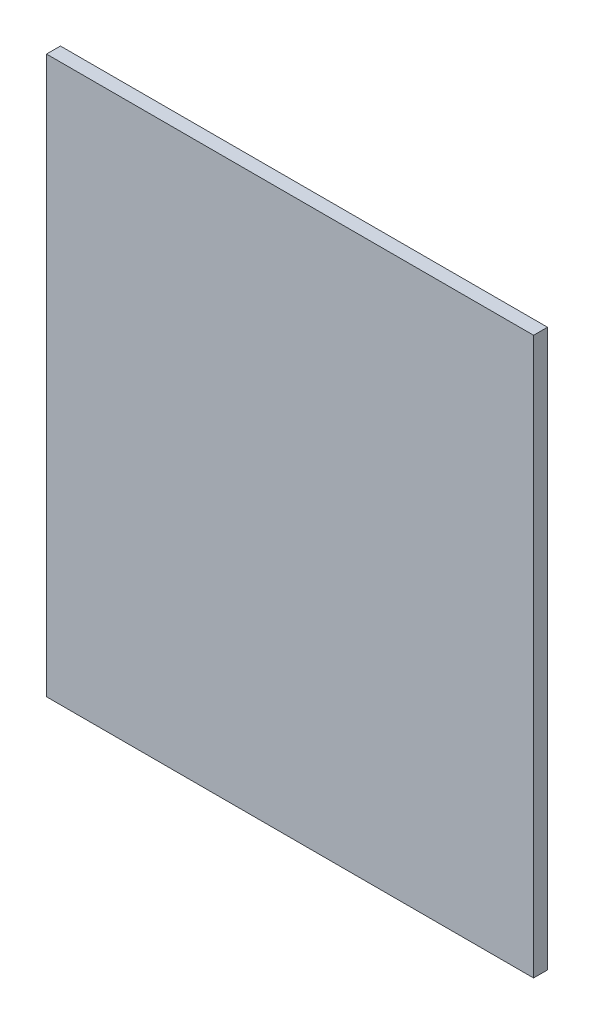
ISO-10303-21;
HEADER;
FILE_DESCRIPTION(('STEP AP214'),'2;1');
FILE_NAME('part.step','',(''),(''),'','','');
FILE_SCHEMA(('AUTOMOTIVE_DESIGN { 1 0 10303 214 1 1 1 1 }'));
ENDSEC;
DATA;
#1=APPLICATION_CONTEXT('core data for automotive mechanical design processes');
#2=APPLICATION_PROTOCOL_DEFINITION('international standard','automotive_design',2000,#1);
#3=PRODUCT_CONTEXT('',#1,'mechanical');
#4=PRODUCT('Part','Part','',(#3));
#5=PRODUCT_RELATED_PRODUCT_CATEGORY('part','',(#4));
#6=PRODUCT_DEFINITION_FORMATION('','',#4);
#7=PRODUCT_DEFINITION_CONTEXT('part definition',#1,'design');
#8=PRODUCT_DEFINITION('design','',#6,#7);
#9=PRODUCT_DEFINITION_SHAPE('','',#8);
#10=(LENGTH_UNIT() NAMED_UNIT(*) SI_UNIT(.MILLI.,.METRE.));
#11=(NAMED_UNIT(*) PLANE_ANGLE_UNIT() SI_UNIT($,.RADIAN.));
#12=(NAMED_UNIT(*) SI_UNIT($,.STERADIAN.) SOLID_ANGLE_UNIT());
#13=UNCERTAINTY_MEASURE_WITH_UNIT(LENGTH_MEASURE(1.E-05),#10,'distance_accuracy_value','');
#14=(GEOMETRIC_REPRESENTATION_CONTEXT(3) GLOBAL_UNCERTAINTY_ASSIGNED_CONTEXT((#13)) GLOBAL_UNIT_ASSIGNED_CONTEXT((#10,
#11,#12)) REPRESENTATION_CONTEXT('',''));
#15=CARTESIAN_POINT('',(0.,0.,0.));
#16=DIRECTION('',(0.,0.,1.));
#17=DIRECTION('',(1.,0.,0.));
#18=AXIS2_PLACEMENT_3D('',#15,#16,#17);
#19=CARTESIAN_POINT('',(0.,0.,2.54));
#20=DIRECTION('',(0.,1.,0.));
#21=DIRECTION('',(0.,0.,1.));
#22=AXIS2_PLACEMENT_3D('',#19,#20,#21);
#23=PLANE('',#22);
#24=DIRECTION('',(1.,0.,0.));
#25=VECTOR('',#24,1.);
#26=CARTESIAN_POINT('',(0.,0.,0.));
#27=LINE('',#26,#25);
#28=CARTESIAN_POINT('',(-88.9,0.,0.));
#29=VERTEX_POINT('',#28);
#30=CARTESIAN_POINT('',(0.,0.,0.));
#31=VERTEX_POINT('',#30);
#32=EDGE_CURVE('E113',#29,#31,#27,.T.);
#33=ORIENTED_EDGE('',*,*,#32,.T.);
#34=DIRECTION('',(0.,0.,-1.));
#35=VECTOR('',#34,1.);
#36=CARTESIAN_POINT('',(0.,0.,2.54));
#37=LINE('',#36,#35);
#38=CARTESIAN_POINT('',(0.,0.,2.54));
#39=VERTEX_POINT('',#38);
#40=EDGE_CURVE('E11',#39,#31,#37,.T.);
#41=ORIENTED_EDGE('',*,*,#40,.F.);
#42=DIRECTION('',(1.,0.,0.));
#43=VECTOR('',#42,1.);
#44=CARTESIAN_POINT('',(0.,0.,2.54));
#45=LINE('',#44,#43);
#46=CARTESIAN_POINT('',(-88.9,0.,2.54));
#47=VERTEX_POINT('',#46);
#48=EDGE_CURVE('E97',#47,#39,#45,.T.);
#49=ORIENTED_EDGE('',*,*,#48,.F.);
#50=DIRECTION('',(0.,0.,-1.));
#51=VECTOR('',#50,1.);
#52=CARTESIAN_POINT('',(-88.9,0.,2.54));
#53=LINE('',#52,#51);
#54=EDGE_CURVE('E109',#47,#29,#53,.T.);
#55=ORIENTED_EDGE('',*,*,#54,.T.);
#56=EDGE_LOOP('',(#33,#41,#49,#55));
#57=FACE_BOUND('',#56,.T.);
#58=ADVANCED_FACE('F45',(#57),#23,.F.);
#59=CARTESIAN_POINT('',(0.,0.,2.54));
#60=DIRECTION('',(-1.,0.,0.));
#61=DIRECTION('',(0.,0.,1.));
#62=AXIS2_PLACEMENT_3D('',#59,#60,#61);
#63=PLANE('',#62);
#64=DIRECTION('',(0.,1.,0.));
#65=VECTOR('',#64,1.);
#66=CARTESIAN_POINT('',(0.,0.,0.));
#67=LINE('',#66,#65);
#68=CARTESIAN_POINT('',(0.,101.6,0.));
#69=VERTEX_POINT('',#68);
#70=EDGE_CURVE('E102',#31,#69,#67,.T.);
#71=ORIENTED_EDGE('',*,*,#70,.T.);
#72=DIRECTION('',(0.,0.,-1.));
#73=VECTOR('',#72,1.);
#74=CARTESIAN_POINT('',(0.,101.6,2.54));
#75=LINE('',#74,#73);
#76=CARTESIAN_POINT('',(0.,101.6,2.54));
#77=VERTEX_POINT('',#76);
#78=EDGE_CURVE('E54',#77,#69,#75,.T.);
#79=ORIENTED_EDGE('',*,*,#78,.F.);
#80=DIRECTION('',(0.,1.,0.));
#81=VECTOR('',#80,1.);
#82=CARTESIAN_POINT('',(0.,0.,2.54));
#83=LINE('',#82,#81);
#84=EDGE_CURVE('E92',#39,#77,#83,.T.);
#85=ORIENTED_EDGE('',*,*,#84,.F.);
#86=ORIENTED_EDGE('',*,*,#40,.T.);
#87=EDGE_LOOP('',(#71,#79,#85,#86));
#88=FACE_BOUND('',#87,.T.);
#89=ADVANCED_FACE('F101',(#88),#63,.F.);
#90=CARTESIAN_POINT('',(0.,101.6,2.54));
#91=DIRECTION('',(0.,-1.,0.));
#92=DIRECTION('',(0.,0.,-1.));
#93=AXIS2_PLACEMENT_3D('',#90,#91,#92);
#94=PLANE('',#93);
#95=DIRECTION('',(-1.,0.,0.));
#96=VECTOR('',#95,1.);
#97=CARTESIAN_POINT('',(0.,101.6,0.));
#98=LINE('',#97,#96);
#99=CARTESIAN_POINT('',(-88.9,101.6,0.));
#100=VERTEX_POINT('',#99);
#101=EDGE_CURVE('E79',#69,#100,#98,.T.);
#102=ORIENTED_EDGE('',*,*,#101,.T.);
#103=DIRECTION('',(0.,0.,-1.));
#104=VECTOR('',#103,1.);
#105=CARTESIAN_POINT('',(-88.9,101.6,2.54));
#106=LINE('',#105,#104);
#107=CARTESIAN_POINT('',(-88.9,101.6,2.54));
#108=VERTEX_POINT('',#107);
#109=EDGE_CURVE('E104',#108,#100,#106,.T.);
#110=ORIENTED_EDGE('',*,*,#109,.F.);
#111=DIRECTION('',(-1.,0.,0.));
#112=VECTOR('',#111,1.);
#113=CARTESIAN_POINT('',(0.,101.6,2.54));
#114=LINE('',#113,#112);
#115=EDGE_CURVE('E95',#77,#108,#114,.T.);
#116=ORIENTED_EDGE('',*,*,#115,.F.);
#117=ORIENTED_EDGE('',*,*,#78,.T.);
#118=EDGE_LOOP('',(#102,#110,#116,#117));
#119=FACE_BOUND('',#118,.T.);
#120=ADVANCED_FACE('F105',(#119),#94,.F.);
#121=CARTESIAN_POINT('',(-88.9,0.,2.54));
#122=DIRECTION('',(1.,0.,0.));
#123=DIRECTION('',(0.,0.,-1.));
#124=AXIS2_PLACEMENT_3D('',#121,#122,#123);
#125=PLANE('',#124);
#126=DIRECTION('',(0.,-1.,0.));
#127=VECTOR('',#126,1.);
#128=CARTESIAN_POINT('',(-88.9,0.,0.));
#129=LINE('',#128,#127);
#130=EDGE_CURVE('E85',#100,#29,#129,.T.);
#131=ORIENTED_EDGE('',*,*,#130,.T.);
#132=ORIENTED_EDGE('',*,*,#54,.F.);
#133=DIRECTION('',(0.,-1.,0.));
#134=VECTOR('',#133,1.);
#135=CARTESIAN_POINT('',(-88.9,0.,2.54));
#136=LINE('',#135,#134);
#137=EDGE_CURVE('E62',#108,#47,#136,.T.);
#138=ORIENTED_EDGE('',*,*,#137,.F.);
#139=ORIENTED_EDGE('',*,*,#109,.T.);
#140=EDGE_LOOP('',(#131,#132,#138,#139));
#141=FACE_BOUND('',#140,.T.);
#142=ADVANCED_FACE('F126',(#141),#125,.F.);
#143=CARTESIAN_POINT('',(0.,0.,2.54));
#144=DIRECTION('',(0.,0.,-1.));
#145=DIRECTION('',(-1.,0.,0.));
#146=AXIS2_PLACEMENT_3D('',#143,#144,#145);
#147=PLANE('',#146);
#148=ORIENTED_EDGE('',*,*,#48,.T.);
#149=ORIENTED_EDGE('',*,*,#84,.T.);
#150=ORIENTED_EDGE('',*,*,#115,.T.);
#151=ORIENTED_EDGE('',*,*,#137,.T.);
#152=EDGE_LOOP('',(#148,#149,#150,#151));
#153=FACE_BOUND('',#152,.T.);
#154=ADVANCED_FACE('F93',(#153),#147,.F.);
#155=CARTESIAN_POINT('',(0.,0.,0.));
#156=DIRECTION('',(0.,0.,-1.));
#157=DIRECTION('',(-1.,0.,0.));
#158=AXIS2_PLACEMENT_3D('',#155,#156,#157);
#159=PLANE('',#158);
#160=ORIENTED_EDGE('',*,*,#32,.F.);
#161=ORIENTED_EDGE('',*,*,#130,.F.);
#162=ORIENTED_EDGE('',*,*,#101,.F.);
#163=ORIENTED_EDGE('',*,*,#70,.F.);
#164=EDGE_LOOP('',(#160,#161,#162,#163));
#165=FACE_BOUND('',#164,.T.);
#166=ADVANCED_FACE('F129',(#165),#159,.T.);
#167=CLOSED_SHELL('',(#58,#89,#120,#142,#154,#166));
#168=MANIFOLD_SOLID_BREP('B2',#167);
#169=ADVANCED_BREP_SHAPE_REPRESENTATION('',(#18,#168),#14);
#170=SHAPE_DEFINITION_REPRESENTATION(#9,#169);
ENDSEC;
END-ISO-10303-21;
